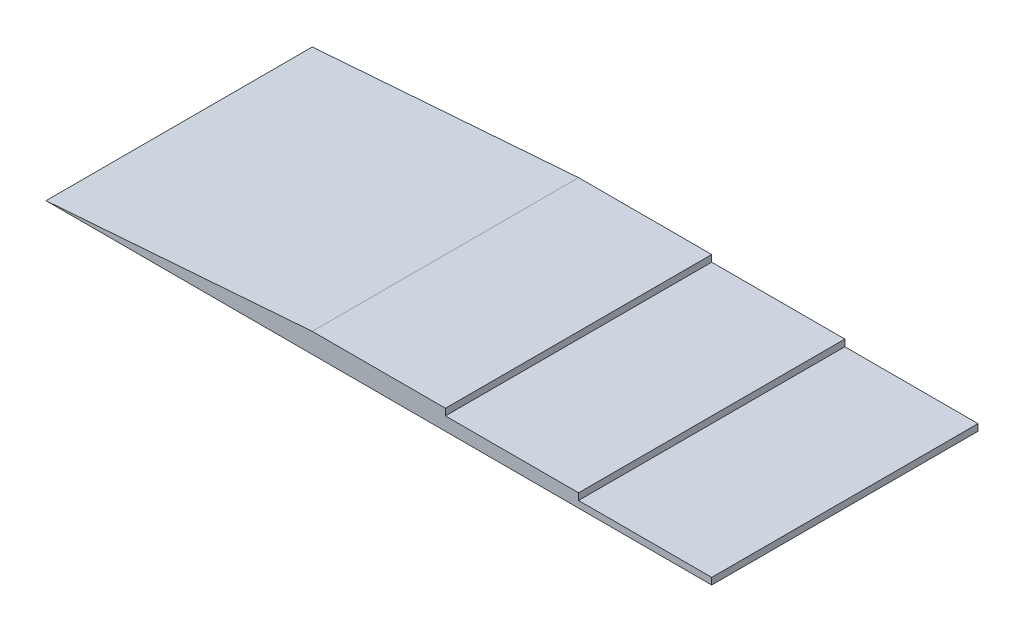
ISO-10303-21;
HEADER;
FILE_DESCRIPTION(('STEP AP214'),'2;1');
FILE_NAME('part.step','',(''),(''),'','','');
FILE_SCHEMA(('AUTOMOTIVE_DESIGN { 1 0 10303 214 1 1 1 1 }'));
ENDSEC;
DATA;
#1=APPLICATION_CONTEXT('core data for automotive mechanical design processes');
#2=APPLICATION_PROTOCOL_DEFINITION('international standard','automotive_design',2000,#1);
#3=PRODUCT_CONTEXT('',#1,'mechanical');
#4=PRODUCT('Part','Part','',(#3));
#5=PRODUCT_RELATED_PRODUCT_CATEGORY('part','',(#4));
#6=PRODUCT_DEFINITION_FORMATION('','',#4);
#7=PRODUCT_DEFINITION_CONTEXT('part definition',#1,'design');
#8=PRODUCT_DEFINITION('design','',#6,#7);
#9=PRODUCT_DEFINITION_SHAPE('','',#8);
#10=(LENGTH_UNIT() NAMED_UNIT(*) SI_UNIT(.MILLI.,.METRE.));
#11=(NAMED_UNIT(*) PLANE_ANGLE_UNIT() SI_UNIT($,.RADIAN.));
#12=(NAMED_UNIT(*) SI_UNIT($,.STERADIAN.) SOLID_ANGLE_UNIT());
#13=UNCERTAINTY_MEASURE_WITH_UNIT(LENGTH_MEASURE(1.E-05),#10,'distance_accuracy_value','');
#14=(GEOMETRIC_REPRESENTATION_CONTEXT(3) GLOBAL_UNCERTAINTY_ASSIGNED_CONTEXT((#13)) GLOBAL_UNIT_ASSIGNED_CONTEXT((#10,
#11,#12)) REPRESENTATION_CONTEXT('',''));
#15=CARTESIAN_POINT('',(0.,0.,0.));
#16=DIRECTION('',(0.,0.,1.));
#17=DIRECTION('',(1.,0.,0.));
#18=AXIS2_PLACEMENT_3D('',#15,#16,#17);
#19=CARTESIAN_POINT('',(0.,-50.,-2000.));
#20=DIRECTION('',(0.,-1.,0.));
#21=DIRECTION('',(0.,0.,-1.));
#22=AXIS2_PLACEMENT_3D('',#19,#20,#21);
#23=PLANE('',#22);
#24=DIRECTION('',(1.,0.,0.));
#25=VECTOR('',#24,1.);
#26=CARTESIAN_POINT('',(0.,-50.,0.));
#27=LINE('',#26,#25);
#28=CARTESIAN_POINT('',(-2000.,-50.,0.));
#29=VERTEX_POINT('',#28);
#30=CARTESIAN_POINT('',(3000.,-50.,0.));
#31=VERTEX_POINT('',#30);
#32=EDGE_CURVE('E130',#29,#31,#27,.T.);
#33=ORIENTED_EDGE('',*,*,#32,.F.);
#34=DIRECTION('',(0.,0.,1.));
#35=VECTOR('',#34,1.);
#36=CARTESIAN_POINT('',(-2000.,-50.,-2000.));
#37=LINE('',#36,#35);
#38=CARTESIAN_POINT('',(-2000.,-50.,-2000.));
#39=VERTEX_POINT('',#38);
#40=EDGE_CURVE('E11',#39,#29,#37,.T.);
#41=ORIENTED_EDGE('',*,*,#40,.F.);
#42=DIRECTION('',(1.,0.,0.));
#43=VECTOR('',#42,1.);
#44=CARTESIAN_POINT('',(0.,-50.,-2000.));
#45=LINE('',#44,#43);
#46=CARTESIAN_POINT('',(3000.,-50.,-2000.));
#47=VERTEX_POINT('',#46);
#48=EDGE_CURVE('E149',#39,#47,#45,.T.);
#49=ORIENTED_EDGE('',*,*,#48,.T.);
#50=DIRECTION('',(0.,0.,1.));
#51=VECTOR('',#50,1.);
#52=CARTESIAN_POINT('',(3000.,-50.,-2000.));
#53=LINE('',#52,#51);
#54=EDGE_CURVE('E36',#47,#31,#53,.T.);
#55=ORIENTED_EDGE('',*,*,#54,.T.);
#56=EDGE_LOOP('',(#33,#41,#49,#55));
#57=FACE_BOUND('',#56,.T.);
#58=ADVANCED_FACE('F33',(#57),#23,.T.);
#59=CARTESIAN_POINT('',(-7.45804847731508,99.4406463642012,-2000.));
#60=DIRECTION('',(-0.0747899482416341,0.997199309888456,0.));
#61=DIRECTION('',(-0.997199309888456,-0.0747899482416341,0.));
#62=AXIS2_PLACEMENT_3D('',#59,#60,#61);
#63=PLANE('',#62);
#64=DIRECTION('',(-0.997199309888456,-0.0747899482416341,0.));
#65=VECTOR('',#64,1.);
#66=CARTESIAN_POINT('',(-7.45804847731508,99.4406463642012,0.));
#67=LINE('',#66,#65);
#68=CARTESIAN_POINT('',(0.,99.9999999999998,0.));
#69=VERTEX_POINT('',#68);
#70=EDGE_CURVE('E147',#69,#29,#67,.T.);
#71=ORIENTED_EDGE('',*,*,#70,.F.);
#72=DIRECTION('',(0.,0.,1.));
#73=VECTOR('',#72,1.);
#74=CARTESIAN_POINT('',(0.,99.9999999999998,-2000.));
#75=LINE('',#74,#73);
#76=CARTESIAN_POINT('',(0.,99.9999999999998,-2000.));
#77=VERTEX_POINT('',#76);
#78=EDGE_CURVE('E42',#77,#69,#75,.T.);
#79=ORIENTED_EDGE('',*,*,#78,.F.);
#80=DIRECTION('',(-0.997199309888456,-0.0747899482416341,0.));
#81=VECTOR('',#80,1.);
#82=CARTESIAN_POINT('',(-7.45804847731508,99.4406463642012,-2000.));
#83=LINE('',#82,#81);
#84=EDGE_CURVE('E120',#77,#39,#83,.T.);
#85=ORIENTED_EDGE('',*,*,#84,.T.);
#86=ORIENTED_EDGE('',*,*,#40,.T.);
#87=EDGE_LOOP('',(#71,#79,#85,#86));
#88=FACE_BOUND('',#87,.T.);
#89=ADVANCED_FACE('F163',(#88),#63,.T.);
#90=CARTESIAN_POINT('',(0.,99.9999999999998,-2000.));
#91=DIRECTION('',(0.,1.,0.));
#92=DIRECTION('',(-1.,0.,0.));
#93=AXIS2_PLACEMENT_3D('',#90,#91,#92);
#94=PLANE('',#93);
#95=DIRECTION('',(-1.,0.,0.));
#96=VECTOR('',#95,1.);
#97=CARTESIAN_POINT('',(0.,99.9999999999998,0.));
#98=LINE('',#97,#96);
#99=CARTESIAN_POINT('',(1000.,99.9999999999999,0.));
#100=VERTEX_POINT('',#99);
#101=EDGE_CURVE('E107',#100,#69,#98,.T.);
#102=ORIENTED_EDGE('',*,*,#101,.F.);
#103=DIRECTION('',(0.,0.,1.));
#104=VECTOR('',#103,1.);
#105=CARTESIAN_POINT('',(1000.,99.9999999999999,-2000.));
#106=LINE('',#105,#104);
#107=CARTESIAN_POINT('',(1000.,99.9999999999999,-2000.));
#108=VERTEX_POINT('',#107);
#109=EDGE_CURVE('E102',#108,#100,#106,.T.);
#110=ORIENTED_EDGE('',*,*,#109,.F.);
#111=DIRECTION('',(-1.,0.,0.));
#112=VECTOR('',#111,1.);
#113=CARTESIAN_POINT('',(0.,99.9999999999998,-2000.));
#114=LINE('',#113,#112);
#115=EDGE_CURVE('E105',#108,#77,#114,.T.);
#116=ORIENTED_EDGE('',*,*,#115,.T.);
#117=ORIENTED_EDGE('',*,*,#78,.T.);
#118=EDGE_LOOP('',(#102,#110,#116,#117));
#119=FACE_BOUND('',#118,.T.);
#120=ADVANCED_FACE('F104',(#119),#94,.T.);
#121=CARTESIAN_POINT('',(1000.,0.,-2000.));
#122=DIRECTION('',(1.,0.,0.));
#123=DIRECTION('',(0.,0.,-1.));
#124=AXIS2_PLACEMENT_3D('',#121,#122,#123);
#125=PLANE('',#124);
#126=DIRECTION('',(0.,1.,0.));
#127=VECTOR('',#126,1.);
#128=CARTESIAN_POINT('',(1000.,0.,0.));
#129=LINE('',#128,#127);
#130=CARTESIAN_POINT('',(1000.,49.9999999999999,0.));
#131=VERTEX_POINT('',#130);
#132=EDGE_CURVE('E144',#131,#100,#129,.T.);
#133=ORIENTED_EDGE('',*,*,#132,.F.);
#134=DIRECTION('',(0.,0.,1.));
#135=VECTOR('',#134,1.);
#136=CARTESIAN_POINT('',(1000.,49.9999999999999,-2000.));
#137=LINE('',#136,#135);
#138=CARTESIAN_POINT('',(1000.,49.9999999999999,-2000.));
#139=VERTEX_POINT('',#138);
#140=EDGE_CURVE('E112',#139,#131,#137,.T.);
#141=ORIENTED_EDGE('',*,*,#140,.F.);
#142=DIRECTION('',(0.,1.,0.));
#143=VECTOR('',#142,1.);
#144=CARTESIAN_POINT('',(1000.,0.,-2000.));
#145=LINE('',#144,#143);
#146=EDGE_CURVE('E118',#139,#108,#145,.T.);
#147=ORIENTED_EDGE('',*,*,#146,.T.);
#148=ORIENTED_EDGE('',*,*,#109,.T.);
#149=EDGE_LOOP('',(#133,#141,#147,#148));
#150=FACE_BOUND('',#149,.T.);
#151=ADVANCED_FACE('F122',(#150),#125,.T.);
#152=CARTESIAN_POINT('',(0.,49.9999999999998,-2000.));
#153=DIRECTION('',(0.,1.,0.));
#154=DIRECTION('',(-1.,0.,0.));
#155=AXIS2_PLACEMENT_3D('',#152,#153,#154);
#156=PLANE('',#155);
#157=DIRECTION('',(-1.,0.,0.));
#158=VECTOR('',#157,1.);
#159=CARTESIAN_POINT('',(0.,49.9999999999998,0.));
#160=LINE('',#159,#158);
#161=CARTESIAN_POINT('',(2000.,50.,0.));
#162=VERTEX_POINT('',#161);
#163=EDGE_CURVE('E141',#162,#131,#160,.T.);
#164=ORIENTED_EDGE('',*,*,#163,.F.);
#165=DIRECTION('',(0.,0.,1.));
#166=VECTOR('',#165,1.);
#167=CARTESIAN_POINT('',(2000.,50.,-2000.));
#168=LINE('',#167,#166);
#169=CARTESIAN_POINT('',(2000.,50.,-2000.));
#170=VERTEX_POINT('',#169);
#171=EDGE_CURVE('E153',#170,#162,#168,.T.);
#172=ORIENTED_EDGE('',*,*,#171,.F.);
#173=DIRECTION('',(-1.,0.,0.));
#174=VECTOR('',#173,1.);
#175=CARTESIAN_POINT('',(0.,49.9999999999998,-2000.));
#176=LINE('',#175,#174);
#177=EDGE_CURVE('E123',#170,#139,#176,.T.);
#178=ORIENTED_EDGE('',*,*,#177,.T.);
#179=ORIENTED_EDGE('',*,*,#140,.T.);
#180=EDGE_LOOP('',(#164,#172,#178,#179));
#181=FACE_BOUND('',#180,.T.);
#182=ADVANCED_FACE('F176',(#181),#156,.T.);
#183=CARTESIAN_POINT('',(2000.,0.,-2000.));
#184=DIRECTION('',(-1.,0.,0.));
#185=DIRECTION('',(0.,0.,1.));
#186=AXIS2_PLACEMENT_3D('',#183,#184,#185);
#187=PLANE('',#186);
#188=DIRECTION('',(0.,-1.,0.));
#189=VECTOR('',#188,1.);
#190=CARTESIAN_POINT('',(2000.,0.,0.));
#191=LINE('',#190,#189);
#192=CARTESIAN_POINT('',(2000.,0.,0.));
#193=VERTEX_POINT('',#192);
#194=EDGE_CURVE('E139',#162,#193,#191,.T.);
#195=ORIENTED_EDGE('',*,*,#194,.T.);
#196=DIRECTION('',(0.,0.,1.));
#197=VECTOR('',#196,1.);
#198=CARTESIAN_POINT('',(2000.,0.,-2000.));
#199=LINE('',#198,#197);
#200=CARTESIAN_POINT('',(2000.,0.,-2000.));
#201=VERTEX_POINT('',#200);
#202=EDGE_CURVE('E155',#201,#193,#199,.T.);
#203=ORIENTED_EDGE('',*,*,#202,.F.);
#204=DIRECTION('',(0.,-1.,0.));
#205=VECTOR('',#204,1.);
#206=CARTESIAN_POINT('',(2000.,0.,-2000.));
#207=LINE('',#206,#205);
#208=EDGE_CURVE('E125',#170,#201,#207,.T.);
#209=ORIENTED_EDGE('',*,*,#208,.F.);
#210=ORIENTED_EDGE('',*,*,#171,.T.);
#211=EDGE_LOOP('',(#195,#203,#209,#210));
#212=FACE_BOUND('',#211,.T.);
#213=ADVANCED_FACE('F179',(#212),#187,.F.);
#214=CARTESIAN_POINT('',(0.,0.,-2000.));
#215=DIRECTION('',(0.,-1.,0.));
#216=DIRECTION('',(1.,0.,0.));
#217=AXIS2_PLACEMENT_3D('',#214,#215,#216);
#218=PLANE('',#217);
#219=DIRECTION('',(1.,0.,0.));
#220=VECTOR('',#219,1.);
#221=CARTESIAN_POINT('',(0.,0.,0.));
#222=LINE('',#221,#220);
#223=CARTESIAN_POINT('',(3000.,0.,0.));
#224=VERTEX_POINT('',#223);
#225=EDGE_CURVE('E136',#193,#224,#222,.T.);
#226=ORIENTED_EDGE('',*,*,#225,.T.);
#227=DIRECTION('',(0.,0.,1.));
#228=VECTOR('',#227,1.);
#229=CARTESIAN_POINT('',(3000.,0.,-2000.));
#230=LINE('',#229,#228);
#231=CARTESIAN_POINT('',(3000.,0.,-2000.));
#232=VERTEX_POINT('',#231);
#233=EDGE_CURVE('E157',#232,#224,#230,.T.);
#234=ORIENTED_EDGE('',*,*,#233,.F.);
#235=DIRECTION('',(1.,0.,0.));
#236=VECTOR('',#235,1.);
#237=CARTESIAN_POINT('',(0.,0.,-2000.));
#238=LINE('',#237,#236);
#239=EDGE_CURVE('E268',#201,#232,#238,.T.);
#240=ORIENTED_EDGE('',*,*,#239,.F.);
#241=ORIENTED_EDGE('',*,*,#202,.T.);
#242=EDGE_LOOP('',(#226,#234,#240,#241));
#243=FACE_BOUND('',#242,.T.);
#244=ADVANCED_FACE('F183',(#243),#218,.F.);
#245=CARTESIAN_POINT('',(3000.,0.,-2000.));
#246=DIRECTION('',(1.,0.,0.));
#247=DIRECTION('',(0.,0.,-1.));
#248=AXIS2_PLACEMENT_3D('',#245,#246,#247);
#249=PLANE('',#248);
#250=DIRECTION('',(0.,1.,0.));
#251=VECTOR('',#250,1.);
#252=CARTESIAN_POINT('',(3000.,0.,0.));
#253=LINE('',#252,#251);
#254=EDGE_CURVE('E133',#31,#224,#253,.T.);
#255=ORIENTED_EDGE('',*,*,#254,.F.);
#256=ORIENTED_EDGE('',*,*,#54,.F.);
#257=DIRECTION('',(0.,1.,0.));
#258=VECTOR('',#257,1.);
#259=CARTESIAN_POINT('',(3000.,0.,-2000.));
#260=LINE('',#259,#258);
#261=EDGE_CURVE('E269',#47,#232,#260,.T.);
#262=ORIENTED_EDGE('',*,*,#261,.T.);
#263=ORIENTED_EDGE('',*,*,#233,.T.);
#264=EDGE_LOOP('',(#255,#256,#262,#263));
#265=FACE_BOUND('',#264,.T.);
#266=ADVANCED_FACE('F159',(#265),#249,.T.);
#267=CARTESIAN_POINT('',(0.,0.,-2000.));
#268=DIRECTION('',(0.,0.,1.));
#269=DIRECTION('',(1.,0.,0.));
#270=AXIS2_PLACEMENT_3D('',#267,#268,#269);
#271=PLANE('',#270);
#272=ORIENTED_EDGE('',*,*,#48,.F.);
#273=ORIENTED_EDGE('',*,*,#84,.F.);
#274=ORIENTED_EDGE('',*,*,#115,.F.);
#275=ORIENTED_EDGE('',*,*,#146,.F.);
#276=ORIENTED_EDGE('',*,*,#177,.F.);
#277=ORIENTED_EDGE('',*,*,#208,.T.);
#278=ORIENTED_EDGE('',*,*,#239,.T.);
#279=ORIENTED_EDGE('',*,*,#261,.F.);
#280=EDGE_LOOP('',(#272,#273,#274,#275,#276,#277,#278,#279));
#281=FACE_BOUND('',#280,.T.);
#282=ADVANCED_FACE('F116',(#281),#271,.F.);
#283=CARTESIAN_POINT('',(0.,0.,0.));
#284=DIRECTION('',(0.,0.,1.));
#285=DIRECTION('',(1.,0.,0.));
#286=AXIS2_PLACEMENT_3D('',#283,#284,#285);
#287=PLANE('',#286);
#288=ORIENTED_EDGE('',*,*,#32,.T.);
#289=ORIENTED_EDGE('',*,*,#254,.T.);
#290=ORIENTED_EDGE('',*,*,#225,.F.);
#291=ORIENTED_EDGE('',*,*,#194,.F.);
#292=ORIENTED_EDGE('',*,*,#163,.T.);
#293=ORIENTED_EDGE('',*,*,#132,.T.);
#294=ORIENTED_EDGE('',*,*,#101,.T.);
#295=ORIENTED_EDGE('',*,*,#70,.T.);
#296=EDGE_LOOP('',(#288,#289,#290,#291,#292,#293,#294,#295));
#297=FACE_BOUND('',#296,.T.);
#298=ADVANCED_FACE('F162',(#297),#287,.T.);
#299=CLOSED_SHELL('',(#58,#89,#120,#151,#182,#213,#244,#266,#282,#298));
#300=MANIFOLD_SOLID_BREP('B2',#299);
#301=ADVANCED_BREP_SHAPE_REPRESENTATION('',(#18,#300),#14);
#302=SHAPE_DEFINITION_REPRESENTATION(#9,#301);
ENDSEC;
END-ISO-10303-21;
